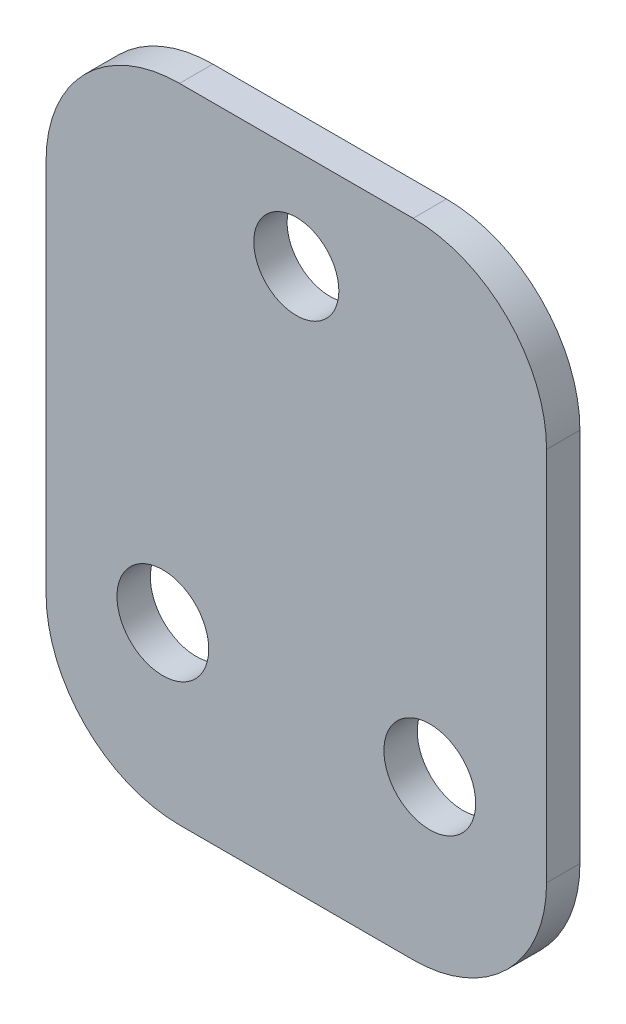
ISO-10303-21;
HEADER;
FILE_DESCRIPTION(('STEP AP214'),'2;1');
FILE_NAME('part.step','',(''),(''),'','','');
FILE_SCHEMA(('AUTOMOTIVE_DESIGN { 1 0 10303 214 1 1 1 1 }'));
ENDSEC;
DATA;
#1=APPLICATION_CONTEXT('core data for automotive mechanical design processes');
#2=APPLICATION_PROTOCOL_DEFINITION('international standard','automotive_design',2000,#1);
#3=PRODUCT_CONTEXT('',#1,'mechanical');
#4=PRODUCT('Part','Part','',(#3));
#5=PRODUCT_RELATED_PRODUCT_CATEGORY('part','',(#4));
#6=PRODUCT_DEFINITION_FORMATION('','',#4);
#7=PRODUCT_DEFINITION_CONTEXT('part definition',#1,'design');
#8=PRODUCT_DEFINITION('design','',#6,#7);
#9=PRODUCT_DEFINITION_SHAPE('','',#8);
#10=(LENGTH_UNIT() NAMED_UNIT(*) SI_UNIT(.MILLI.,.METRE.));
#11=(NAMED_UNIT(*) PLANE_ANGLE_UNIT() SI_UNIT($,.RADIAN.));
#12=(NAMED_UNIT(*) SI_UNIT($,.STERADIAN.) SOLID_ANGLE_UNIT());
#13=UNCERTAINTY_MEASURE_WITH_UNIT(LENGTH_MEASURE(1.E-05),#10,'distance_accuracy_value','');
#14=(GEOMETRIC_REPRESENTATION_CONTEXT(3) GLOBAL_UNCERTAINTY_ASSIGNED_CONTEXT((#13)) GLOBAL_UNIT_ASSIGNED_CONTEXT((#10,
#11,#12)) REPRESENTATION_CONTEXT('',''));
#15=CARTESIAN_POINT('',(0.,0.,0.));
#16=DIRECTION('',(0.,0.,1.));
#17=DIRECTION('',(1.,0.,0.));
#18=AXIS2_PLACEMENT_3D('',#15,#16,#17);
#19=CARTESIAN_POINT('',(0.,0.,2.));
#20=DIRECTION('',(0.,0.,-1.));
#21=DIRECTION('',(-1.,0.,0.));
#22=AXIS2_PLACEMENT_3D('',#19,#20,#21);
#23=PLANE('',#22);
#24=DIRECTION('',(1.,0.,0.));
#25=VECTOR('',#24,1.);
#26=CARTESIAN_POINT('',(-15.,-20.,2.));
#27=LINE('',#26,#25);
#28=CARTESIAN_POINT('',(-7.,-20.,2.));
#29=VERTEX_POINT('',#28);
#30=CARTESIAN_POINT('',(7.,-20.,2.));
#31=VERTEX_POINT('',#30);
#32=EDGE_CURVE('E139',#29,#31,#27,.T.);
#33=ORIENTED_EDGE('',*,*,#32,.T.);
#34=CARTESIAN_POINT('',(7.,-12.,2.));
#35=DIRECTION('',(0.,0.,-1.));
#36=DIRECTION('',(-1.,0.,0.));
#37=AXIS2_PLACEMENT_3D('',#34,#35,#36);
#38=CIRCLE('',#37,8.);
#39=CARTESIAN_POINT('',(15.,-12.,2.));
#40=VERTEX_POINT('',#39);
#41=EDGE_CURVE('E157',#31,#40,#38,.F.);
#42=ORIENTED_EDGE('',*,*,#41,.T.);
#43=DIRECTION('',(0.,1.,0.));
#44=VECTOR('',#43,1.);
#45=CARTESIAN_POINT('',(15.,-20.,2.));
#46=LINE('',#45,#44);
#47=CARTESIAN_POINT('',(15.,10.5,2.));
#48=VERTEX_POINT('',#47);
#49=EDGE_CURVE('E121',#40,#48,#46,.T.);
#50=ORIENTED_EDGE('',*,*,#49,.T.);
#51=CARTESIAN_POINT('',(7.,10.5,2.));
#52=DIRECTION('',(0.,0.,-1.));
#53=DIRECTION('',(-1.,0.,0.));
#54=AXIS2_PLACEMENT_3D('',#51,#52,#53);
#55=CIRCLE('',#54,8.);
#56=CARTESIAN_POINT('',(7.,18.5,2.));
#57=VERTEX_POINT('',#56);
#58=EDGE_CURVE('E153',#48,#57,#55,.F.);
#59=ORIENTED_EDGE('',*,*,#58,.T.);
#60=DIRECTION('',(-1.,0.,0.));
#61=VECTOR('',#60,1.);
#62=CARTESIAN_POINT('',(-15.,18.5,2.));
#63=LINE('',#62,#61);
#64=CARTESIAN_POINT('',(-7.,18.5,2.));
#65=VERTEX_POINT('',#64);
#66=EDGE_CURVE('E166',#57,#65,#63,.T.);
#67=ORIENTED_EDGE('',*,*,#66,.T.);
#68=CARTESIAN_POINT('',(-7.,10.5,2.));
#69=DIRECTION('',(0.,0.,-1.));
#70=DIRECTION('',(-1.,0.,0.));
#71=AXIS2_PLACEMENT_3D('',#68,#69,#70);
#72=CIRCLE('',#71,8.);
#73=CARTESIAN_POINT('',(-15.,10.5,2.));
#74=VERTEX_POINT('',#73);
#75=EDGE_CURVE('E56',#65,#74,#72,.F.);
#76=ORIENTED_EDGE('',*,*,#75,.T.);
#77=DIRECTION('',(0.,-1.,0.));
#78=VECTOR('',#77,1.);
#79=CARTESIAN_POINT('',(-15.,-20.,2.));
#80=LINE('',#79,#78);
#81=CARTESIAN_POINT('',(-15.,-12.,2.));
#82=VERTEX_POINT('',#81);
#83=EDGE_CURVE('E172',#74,#82,#80,.T.);
#84=ORIENTED_EDGE('',*,*,#83,.T.);
#85=CARTESIAN_POINT('',(-7.,-12.,2.));
#86=DIRECTION('',(0.,0.,-1.));
#87=DIRECTION('',(-1.,0.,0.));
#88=AXIS2_PLACEMENT_3D('',#85,#86,#87);
#89=CIRCLE('',#88,8.);
#90=EDGE_CURVE('E155',#82,#29,#89,.F.);
#91=ORIENTED_EDGE('',*,*,#90,.T.);
#92=EDGE_LOOP('',(#33,#42,#50,#59,#67,#76,#84,#91));
#93=FACE_BOUND('',#92,.T.);
#94=CARTESIAN_POINT('',(0.,12.5,2.));
#95=DIRECTION('',(0.,0.,1.));
#96=DIRECTION('',(1.,0.,0.));
#97=AXIS2_PLACEMENT_3D('',#94,#95,#96);
#98=CIRCLE('',#97,2.55);
#99=CARTESIAN_POINT('',(2.55,12.5,2.));
#100=VERTEX_POINT('',#99);
#101=EDGE_CURVE('E130',#100,#100,#98,.T.);
#102=ORIENTED_EDGE('',*,*,#101,.F.);
#103=EDGE_LOOP('',(#102));
#104=FACE_BOUND('',#103,.T.);
#105=CARTESIAN_POINT('',(-8.,-10.,2.));
#106=DIRECTION('',(0.,0.,1.));
#107=DIRECTION('',(1.,0.,0.));
#108=AXIS2_PLACEMENT_3D('',#105,#106,#107);
#109=CIRCLE('',#108,2.75);
#110=CARTESIAN_POINT('',(-5.25,-10.,2.));
#111=VERTEX_POINT('',#110);
#112=EDGE_CURVE('E187',#111,#111,#109,.T.);
#113=ORIENTED_EDGE('',*,*,#112,.F.);
#114=EDGE_LOOP('',(#113));
#115=FACE_BOUND('',#114,.T.);
#116=CARTESIAN_POINT('',(8.,-10.,2.));
#117=DIRECTION('',(0.,0.,1.));
#118=DIRECTION('',(1.,0.,0.));
#119=AXIS2_PLACEMENT_3D('',#116,#117,#118);
#120=CIRCLE('',#119,2.75);
#121=CARTESIAN_POINT('',(10.75,-10.,2.));
#122=VERTEX_POINT('',#121);
#123=EDGE_CURVE('E192',#122,#122,#120,.T.);
#124=ORIENTED_EDGE('',*,*,#123,.F.);
#125=EDGE_LOOP('',(#124));
#126=FACE_BOUND('',#125,.T.);
#127=ADVANCED_FACE('F34',(#93,#104,#115,#126),#23,.F.);
#128=CARTESIAN_POINT('',(0.,0.,0.));
#129=DIRECTION('',(0.,0.,-1.));
#130=DIRECTION('',(-1.,0.,0.));
#131=AXIS2_PLACEMENT_3D('',#128,#129,#130);
#132=PLANE('',#131);
#133=CARTESIAN_POINT('',(-8.,-10.,0.));
#134=DIRECTION('',(0.,0.,1.));
#135=DIRECTION('',(1.,0.,0.));
#136=AXIS2_PLACEMENT_3D('',#133,#134,#135);
#137=CIRCLE('',#136,2.75);
#138=CARTESIAN_POINT('',(-5.25,-10.,0.));
#139=VERTEX_POINT('',#138);
#140=EDGE_CURVE('E189',#139,#139,#137,.T.);
#141=ORIENTED_EDGE('',*,*,#140,.T.);
#142=EDGE_LOOP('',(#141));
#143=FACE_BOUND('',#142,.T.);
#144=DIRECTION('',(0.,1.,0.));
#145=VECTOR('',#144,1.);
#146=CARTESIAN_POINT('',(15.,-20.,0.));
#147=LINE('',#146,#145);
#148=CARTESIAN_POINT('',(15.,-12.,0.));
#149=VERTEX_POINT('',#148);
#150=CARTESIAN_POINT('',(15.,10.5,0.));
#151=VERTEX_POINT('',#150);
#152=EDGE_CURVE('E118',#149,#151,#147,.T.);
#153=ORIENTED_EDGE('',*,*,#152,.F.);
#154=CARTESIAN_POINT('',(7.,-12.,0.));
#155=DIRECTION('',(0.,0.,-1.));
#156=DIRECTION('',(-1.,0.,0.));
#157=AXIS2_PLACEMENT_3D('',#154,#155,#156);
#158=CIRCLE('',#157,8.);
#159=CARTESIAN_POINT('',(7.,-20.,0.));
#160=VERTEX_POINT('',#159);
#161=EDGE_CURVE('E101',#149,#160,#158,.T.);
#162=ORIENTED_EDGE('',*,*,#161,.T.);
#163=DIRECTION('',(1.,0.,0.));
#164=VECTOR('',#163,1.);
#165=CARTESIAN_POINT('',(-15.,-20.,0.));
#166=LINE('',#165,#164);
#167=CARTESIAN_POINT('',(-7.,-20.,0.));
#168=VERTEX_POINT('',#167);
#169=EDGE_CURVE('E143',#168,#160,#166,.T.);
#170=ORIENTED_EDGE('',*,*,#169,.F.);
#171=CARTESIAN_POINT('',(-7.,-12.,0.));
#172=DIRECTION('',(0.,0.,-1.));
#173=DIRECTION('',(-1.,0.,0.));
#174=AXIS2_PLACEMENT_3D('',#171,#172,#173);
#175=CIRCLE('',#174,8.);
#176=CARTESIAN_POINT('',(-15.,-12.,0.));
#177=VERTEX_POINT('',#176);
#178=EDGE_CURVE('E112',#168,#177,#175,.T.);
#179=ORIENTED_EDGE('',*,*,#178,.T.);
#180=DIRECTION('',(0.,-1.,0.));
#181=VECTOR('',#180,1.);
#182=CARTESIAN_POINT('',(-15.,-20.,0.));
#183=LINE('',#182,#181);
#184=CARTESIAN_POINT('',(-15.,10.5,0.));
#185=VERTEX_POINT('',#184);
#186=EDGE_CURVE('E133',#185,#177,#183,.T.);
#187=ORIENTED_EDGE('',*,*,#186,.F.);
#188=CARTESIAN_POINT('',(-7.,10.5,0.));
#189=DIRECTION('',(0.,0.,-1.));
#190=DIRECTION('',(-1.,0.,0.));
#191=AXIS2_PLACEMENT_3D('',#188,#189,#190);
#192=CIRCLE('',#191,8.);
#193=CARTESIAN_POINT('',(-7.,18.5,0.));
#194=VERTEX_POINT('',#193);
#195=EDGE_CURVE('E122',#185,#194,#192,.T.);
#196=ORIENTED_EDGE('',*,*,#195,.T.);
#197=DIRECTION('',(-1.,0.,0.));
#198=VECTOR('',#197,1.);
#199=CARTESIAN_POINT('',(-15.,18.5,0.));
#200=LINE('',#199,#198);
#201=CARTESIAN_POINT('',(7.,18.5,0.));
#202=VERTEX_POINT('',#201);
#203=EDGE_CURVE('E129',#202,#194,#200,.T.);
#204=ORIENTED_EDGE('',*,*,#203,.F.);
#205=CARTESIAN_POINT('',(7.,10.5,0.));
#206=DIRECTION('',(0.,0.,-1.));
#207=DIRECTION('',(-1.,0.,0.));
#208=AXIS2_PLACEMENT_3D('',#205,#206,#207);
#209=CIRCLE('',#208,8.);
#210=EDGE_CURVE('E128',#202,#151,#209,.T.);
#211=ORIENTED_EDGE('',*,*,#210,.T.);
#212=EDGE_LOOP('',(#153,#162,#170,#179,#187,#196,#204,#211));
#213=FACE_BOUND('',#212,.T.);
#214=CARTESIAN_POINT('',(0.,12.5,0.));
#215=DIRECTION('',(0.,0.,1.));
#216=DIRECTION('',(1.,0.,0.));
#217=AXIS2_PLACEMENT_3D('',#214,#215,#216);
#218=CIRCLE('',#217,2.55);
#219=CARTESIAN_POINT('',(2.55,12.5,0.));
#220=VERTEX_POINT('',#219);
#221=EDGE_CURVE('E136',#220,#220,#218,.T.);
#222=ORIENTED_EDGE('',*,*,#221,.T.);
#223=EDGE_LOOP('',(#222));
#224=FACE_BOUND('',#223,.T.);
#225=CARTESIAN_POINT('',(8.,-10.,0.));
#226=DIRECTION('',(0.,0.,1.));
#227=DIRECTION('',(1.,0.,0.));
#228=AXIS2_PLACEMENT_3D('',#225,#226,#227);
#229=CIRCLE('',#228,2.75);
#230=CARTESIAN_POINT('',(10.75,-10.,0.));
#231=VERTEX_POINT('',#230);
#232=EDGE_CURVE('E195',#231,#231,#229,.T.);
#233=ORIENTED_EDGE('',*,*,#232,.T.);
#234=EDGE_LOOP('',(#233));
#235=FACE_BOUND('',#234,.T.);
#236=ADVANCED_FACE('F125',(#143,#213,#224,#235),#132,.T.);
#237=CARTESIAN_POINT('',(15.,-20.,2.));
#238=DIRECTION('',(-1.,0.,0.));
#239=DIRECTION('',(0.,0.,1.));
#240=AXIS2_PLACEMENT_3D('',#237,#238,#239);
#241=PLANE('',#240);
#242=ORIENTED_EDGE('',*,*,#49,.F.);
#243=DIRECTION('',(0.,0.,-1.));
#244=VECTOR('',#243,1.);
#245=CARTESIAN_POINT('',(15.,-12.,2.));
#246=LINE('',#245,#244);
#247=EDGE_CURVE('E105',#40,#149,#246,.T.);
#248=ORIENTED_EDGE('',*,*,#247,.T.);
#249=ORIENTED_EDGE('',*,*,#152,.T.);
#250=DIRECTION('',(0.,0.,-1.));
#251=VECTOR('',#250,1.);
#252=CARTESIAN_POINT('',(15.,10.5,2.));
#253=LINE('',#252,#251);
#254=EDGE_CURVE('E123',#151,#48,#253,.F.);
#255=ORIENTED_EDGE('',*,*,#254,.T.);
#256=EDGE_LOOP('',(#242,#248,#249,#255));
#257=FACE_BOUND('',#256,.T.);
#258=ADVANCED_FACE('F117',(#257),#241,.F.);
#259=CARTESIAN_POINT('',(-15.,18.5,2.));
#260=DIRECTION('',(0.,-1.,0.));
#261=DIRECTION('',(0.,0.,-1.));
#262=AXIS2_PLACEMENT_3D('',#259,#260,#261);
#263=PLANE('',#262);
#264=ORIENTED_EDGE('',*,*,#66,.F.);
#265=DIRECTION('',(0.,0.,-1.));
#266=VECTOR('',#265,1.);
#267=CARTESIAN_POINT('',(7.,18.5,2.));
#268=LINE('',#267,#266);
#269=EDGE_CURVE('E11',#57,#202,#268,.T.);
#270=ORIENTED_EDGE('',*,*,#269,.T.);
#271=ORIENTED_EDGE('',*,*,#203,.T.);
#272=DIRECTION('',(0.,0.,-1.));
#273=VECTOR('',#272,1.);
#274=CARTESIAN_POINT('',(-7.,18.5,2.));
#275=LINE('',#274,#273);
#276=EDGE_CURVE('E42',#194,#65,#275,.F.);
#277=ORIENTED_EDGE('',*,*,#276,.T.);
#278=EDGE_LOOP('',(#264,#270,#271,#277));
#279=FACE_BOUND('',#278,.T.);
#280=ADVANCED_FACE('F165',(#279),#263,.F.);
#281=CARTESIAN_POINT('',(-15.,-20.,2.));
#282=DIRECTION('',(1.,0.,0.));
#283=DIRECTION('',(0.,0.,-1.));
#284=AXIS2_PLACEMENT_3D('',#281,#282,#283);
#285=PLANE('',#284);
#286=ORIENTED_EDGE('',*,*,#186,.T.);
#287=DIRECTION('',(0.,0.,-1.));
#288=VECTOR('',#287,1.);
#289=CARTESIAN_POINT('',(-15.,-12.,2.));
#290=LINE('',#289,#288);
#291=EDGE_CURVE('E49',#177,#82,#290,.F.);
#292=ORIENTED_EDGE('',*,*,#291,.T.);
#293=ORIENTED_EDGE('',*,*,#83,.F.);
#294=DIRECTION('',(0.,0.,-1.));
#295=VECTOR('',#294,1.);
#296=CARTESIAN_POINT('',(-15.,10.5,2.));
#297=LINE('',#296,#295);
#298=EDGE_CURVE('E159',#74,#185,#297,.T.);
#299=ORIENTED_EDGE('',*,*,#298,.T.);
#300=EDGE_LOOP('',(#286,#292,#293,#299));
#301=FACE_BOUND('',#300,.T.);
#302=ADVANCED_FACE('F176',(#301),#285,.F.);
#303=CARTESIAN_POINT('',(-15.,-20.,2.));
#304=DIRECTION('',(0.,1.,0.));
#305=DIRECTION('',(-1.,0.,0.));
#306=AXIS2_PLACEMENT_3D('',#303,#304,#305);
#307=PLANE('',#306);
#308=ORIENTED_EDGE('',*,*,#169,.T.);
#309=DIRECTION('',(0.,0.,-1.));
#310=VECTOR('',#309,1.);
#311=CARTESIAN_POINT('',(7.,-20.,2.));
#312=LINE('',#311,#310);
#313=EDGE_CURVE('E106',#160,#31,#312,.F.);
#314=ORIENTED_EDGE('',*,*,#313,.T.);
#315=ORIENTED_EDGE('',*,*,#32,.F.);
#316=DIRECTION('',(0.,0.,-1.));
#317=VECTOR('',#316,1.);
#318=CARTESIAN_POINT('',(-7.,-20.,2.));
#319=LINE('',#318,#317);
#320=EDGE_CURVE('E111',#29,#168,#319,.T.);
#321=ORIENTED_EDGE('',*,*,#320,.T.);
#322=EDGE_LOOP('',(#308,#314,#315,#321));
#323=FACE_BOUND('',#322,.T.);
#324=ADVANCED_FACE('F183',(#323),#307,.F.);
#325=CARTESIAN_POINT('',(0.,12.5,2.));
#326=DIRECTION('',(0.,0.,-1.));
#327=DIRECTION('',(-1.,0.,0.));
#328=AXIS2_PLACEMENT_3D('',#325,#326,#327);
#329=CYLINDRICAL_SURFACE('',#328,2.55);
#330=ORIENTED_EDGE('',*,*,#101,.T.);
#331=EDGE_LOOP('',(#330));
#332=FACE_BOUND('',#331,.T.);
#333=ORIENTED_EDGE('',*,*,#221,.F.);
#334=EDGE_LOOP('',(#333));
#335=FACE_BOUND('',#334,.T.);
#336=ADVANCED_FACE('F212',(#332,#335),#329,.F.);
#337=CARTESIAN_POINT('',(-8.,-10.,2.));
#338=DIRECTION('',(0.,0.,-1.));
#339=DIRECTION('',(-1.,0.,0.));
#340=AXIS2_PLACEMENT_3D('',#337,#338,#339);
#341=CYLINDRICAL_SURFACE('',#340,2.75);
#342=ORIENTED_EDGE('',*,*,#112,.T.);
#343=EDGE_LOOP('',(#342));
#344=FACE_BOUND('',#343,.T.);
#345=ORIENTED_EDGE('',*,*,#140,.F.);
#346=EDGE_LOOP('',(#345));
#347=FACE_BOUND('',#346,.T.);
#348=ADVANCED_FACE('F295',(#344,#347),#341,.F.);
#349=CARTESIAN_POINT('',(8.,-10.,2.));
#350=DIRECTION('',(0.,0.,-1.));
#351=DIRECTION('',(-1.,0.,0.));
#352=AXIS2_PLACEMENT_3D('',#349,#350,#351);
#353=CYLINDRICAL_SURFACE('',#352,2.75);
#354=ORIENTED_EDGE('',*,*,#123,.T.);
#355=EDGE_LOOP('',(#354));
#356=FACE_BOUND('',#355,.T.);
#357=ORIENTED_EDGE('',*,*,#232,.F.);
#358=EDGE_LOOP('',(#357));
#359=FACE_BOUND('',#358,.T.);
#360=ADVANCED_FACE('F201',(#356,#359),#353,.F.);
#361=CARTESIAN_POINT('',(7.,-12.,2.));
#362=DIRECTION('',(0.,0.,-1.));
#363=DIRECTION('',(-1.,0.,0.));
#364=AXIS2_PLACEMENT_3D('',#361,#362,#363);
#365=CYLINDRICAL_SURFACE('',#364,8.);
#366=ORIENTED_EDGE('',*,*,#41,.F.);
#367=ORIENTED_EDGE('',*,*,#313,.F.);
#368=ORIENTED_EDGE('',*,*,#161,.F.);
#369=ORIENTED_EDGE('',*,*,#247,.F.);
#370=EDGE_LOOP('',(#366,#367,#368,#369));
#371=FACE_BOUND('',#370,.T.);
#372=ADVANCED_FACE('F104',(#371),#365,.T.);
#373=CARTESIAN_POINT('',(-7.,-12.,2.));
#374=DIRECTION('',(0.,0.,-1.));
#375=DIRECTION('',(-1.,0.,0.));
#376=AXIS2_PLACEMENT_3D('',#373,#374,#375);
#377=CYLINDRICAL_SURFACE('',#376,8.);
#378=ORIENTED_EDGE('',*,*,#90,.F.);
#379=ORIENTED_EDGE('',*,*,#291,.F.);
#380=ORIENTED_EDGE('',*,*,#178,.F.);
#381=ORIENTED_EDGE('',*,*,#320,.F.);
#382=EDGE_LOOP('',(#378,#379,#380,#381));
#383=FACE_BOUND('',#382,.T.);
#384=ADVANCED_FACE('F180',(#383),#377,.T.);
#385=CARTESIAN_POINT('',(7.,10.5,2.));
#386=DIRECTION('',(0.,0.,-1.));
#387=DIRECTION('',(-1.,0.,0.));
#388=AXIS2_PLACEMENT_3D('',#385,#386,#387);
#389=CYLINDRICAL_SURFACE('',#388,8.);
#390=ORIENTED_EDGE('',*,*,#58,.F.);
#391=ORIENTED_EDGE('',*,*,#254,.F.);
#392=ORIENTED_EDGE('',*,*,#210,.F.);
#393=ORIENTED_EDGE('',*,*,#269,.F.);
#394=EDGE_LOOP('',(#390,#391,#392,#393));
#395=FACE_BOUND('',#394,.T.);
#396=ADVANCED_FACE('F226',(#395),#389,.T.);
#397=CARTESIAN_POINT('',(-7.,10.5,2.));
#398=DIRECTION('',(0.,0.,-1.));
#399=DIRECTION('',(-1.,0.,0.));
#400=AXIS2_PLACEMENT_3D('',#397,#398,#399);
#401=CYLINDRICAL_SURFACE('',#400,8.);
#402=ORIENTED_EDGE('',*,*,#75,.F.);
#403=ORIENTED_EDGE('',*,*,#276,.F.);
#404=ORIENTED_EDGE('',*,*,#195,.F.);
#405=ORIENTED_EDGE('',*,*,#298,.F.);
#406=EDGE_LOOP('',(#402,#403,#404,#405));
#407=FACE_BOUND('',#406,.T.);
#408=ADVANCED_FACE('F36',(#407),#401,.T.);
#409=CLOSED_SHELL('',(#127,#236,#258,#280,#302,#324,#336,#348,#360,#372,#384,#396,#408));
#410=MANIFOLD_SOLID_BREP('B2',#409);
#411=ADVANCED_BREP_SHAPE_REPRESENTATION('',(#18,#410),#14);
#412=SHAPE_DEFINITION_REPRESENTATION(#9,#411);
ENDSEC;
END-ISO-10303-21;
